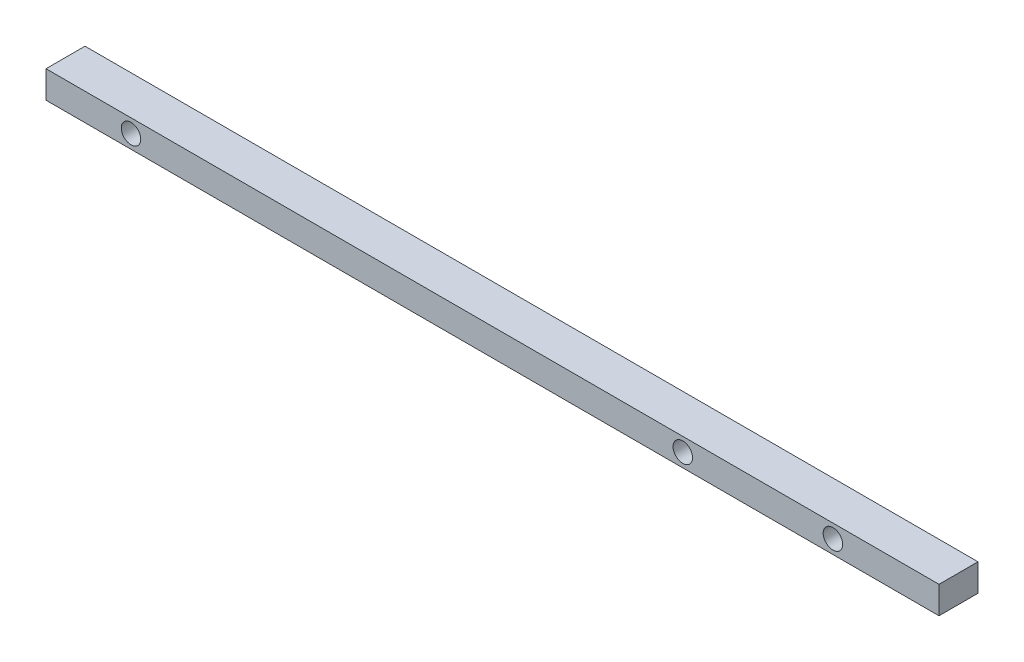
ISO-10303-21;
HEADER;
FILE_DESCRIPTION(('STEP AP214'),'2;1');
FILE_NAME('part.step','',(''),(''),'','','');
FILE_SCHEMA(('AUTOMOTIVE_DESIGN { 1 0 10303 214 1 1 1 1 }'));
ENDSEC;
DATA;
#1=APPLICATION_CONTEXT('core data for automotive mechanical design processes');
#2=APPLICATION_PROTOCOL_DEFINITION('international standard','automotive_design',2000,#1);
#3=PRODUCT_CONTEXT('',#1,'mechanical');
#4=PRODUCT('Part','Part','',(#3));
#5=PRODUCT_RELATED_PRODUCT_CATEGORY('part','',(#4));
#6=PRODUCT_DEFINITION_FORMATION('','',#4);
#7=PRODUCT_DEFINITION_CONTEXT('part definition',#1,'design');
#8=PRODUCT_DEFINITION('design','',#6,#7);
#9=PRODUCT_DEFINITION_SHAPE('','',#8);
#10=(LENGTH_UNIT() NAMED_UNIT(*) SI_UNIT(.MILLI.,.METRE.));
#11=(NAMED_UNIT(*) PLANE_ANGLE_UNIT() SI_UNIT($,.RADIAN.));
#12=(NAMED_UNIT(*) SI_UNIT($,.STERADIAN.) SOLID_ANGLE_UNIT());
#13=UNCERTAINTY_MEASURE_WITH_UNIT(LENGTH_MEASURE(1.E-05),#10,'distance_accuracy_value','');
#14=(GEOMETRIC_REPRESENTATION_CONTEXT(3) GLOBAL_UNCERTAINTY_ASSIGNED_CONTEXT((#13)) GLOBAL_UNIT_ASSIGNED_CONTEXT((#10,
#11,#12)) REPRESENTATION_CONTEXT('',''));
#15=CARTESIAN_POINT('',(0.,0.,0.));
#16=DIRECTION('',(0.,0.,1.));
#17=DIRECTION('',(1.,0.,0.));
#18=AXIS2_PLACEMENT_3D('',#15,#16,#17);
#19=CARTESIAN_POINT('',(58.166,0.,0.));
#20=DIRECTION('',(0.,0.,-1.));
#21=DIRECTION('',(-1.,0.,0.));
#22=AXIS2_PLACEMENT_3D('',#19,#20,#21);
#23=PLANE('',#22);
#24=CARTESIAN_POINT('',(41.4782,0.889,0.));
#25=DIRECTION('',(0.,0.,1.));
#26=DIRECTION('',(1.,0.,0.));
#27=AXIS2_PLACEMENT_3D('',#24,#25,#26);
#28=CIRCLE('',#27,0.634999999999995);
#29=CARTESIAN_POINT('',(42.1132,0.889,0.));
#30=VERTEX_POINT('',#29);
#31=EDGE_CURVE('E144',#30,#30,#28,.T.);
#32=ORIENTED_EDGE('',*,*,#31,.F.);
#33=EDGE_LOOP('',(#32));
#34=FACE_BOUND('',#33,.T.);
#35=CARTESIAN_POINT('',(51.2572,0.889,0.));
#36=DIRECTION('',(0.,0.,1.));
#37=DIRECTION('',(1.,0.,0.));
#38=AXIS2_PLACEMENT_3D('',#35,#36,#37);
#39=CIRCLE('',#38,0.634999999999995);
#40=CARTESIAN_POINT('',(51.8922,0.889,0.));
#41=VERTEX_POINT('',#40);
#42=EDGE_CURVE('E136',#41,#41,#39,.T.);
#43=ORIENTED_EDGE('',*,*,#42,.F.);
#44=EDGE_LOOP('',(#43));
#45=FACE_BOUND('',#44,.T.);
#46=CARTESIAN_POINT('',(5.5372,0.889,0.));
#47=DIRECTION('',(0.,0.,1.));
#48=DIRECTION('',(1.,0.,0.));
#49=AXIS2_PLACEMENT_3D('',#46,#47,#48);
#50=CIRCLE('',#49,0.635000000000001);
#51=CARTESIAN_POINT('',(6.1722,0.889,0.));
#52=VERTEX_POINT('',#51);
#53=EDGE_CURVE('E128',#52,#52,#50,.T.);
#54=ORIENTED_EDGE('',*,*,#53,.F.);
#55=EDGE_LOOP('',(#54));
#56=FACE_BOUND('',#55,.T.);
#57=DIRECTION('',(0.,-1.,0.));
#58=VECTOR('',#57,1.);
#59=CARTESIAN_POINT('',(0.,0.,0.));
#60=LINE('',#59,#58);
#61=CARTESIAN_POINT('',(0.,1.778,0.));
#62=VERTEX_POINT('',#61);
#63=CARTESIAN_POINT('',(0.,0.,0.));
#64=VERTEX_POINT('',#63);
#65=EDGE_CURVE('E107',#62,#64,#60,.T.);
#66=ORIENTED_EDGE('',*,*,#65,.T.);
#67=DIRECTION('',(-1.,0.,0.));
#68=VECTOR('',#67,1.);
#69=CARTESIAN_POINT('',(58.166,0.,0.));
#70=LINE('',#69,#68);
#71=CARTESIAN_POINT('',(58.166,0.,0.));
#72=VERTEX_POINT('',#71);
#73=EDGE_CURVE('E11',#72,#64,#70,.T.);
#74=ORIENTED_EDGE('',*,*,#73,.F.);
#75=DIRECTION('',(0.,-1.,0.));
#76=VECTOR('',#75,1.);
#77=CARTESIAN_POINT('',(58.166,0.,0.));
#78=LINE('',#77,#76);
#79=CARTESIAN_POINT('',(58.166,1.778,0.));
#80=VERTEX_POINT('',#79);
#81=EDGE_CURVE('E91',#80,#72,#78,.T.);
#82=ORIENTED_EDGE('',*,*,#81,.F.);
#83=DIRECTION('',(-1.,0.,0.));
#84=VECTOR('',#83,1.);
#85=CARTESIAN_POINT('',(58.166,1.778,0.));
#86=LINE('',#85,#84);
#87=EDGE_CURVE('E103',#80,#62,#86,.T.);
#88=ORIENTED_EDGE('',*,*,#87,.T.);
#89=EDGE_LOOP('',(#66,#74,#82,#88));
#90=FACE_BOUND('',#89,.T.);
#91=ADVANCED_FACE('F39',(#34,#45,#56,#90),#23,.F.);
#92=CARTESIAN_POINT('',(58.166,0.,0.));
#93=DIRECTION('',(0.,1.,0.));
#94=DIRECTION('',(0.,0.,1.));
#95=AXIS2_PLACEMENT_3D('',#92,#93,#94);
#96=PLANE('',#95);
#97=DIRECTION('',(0.,0.,-1.));
#98=VECTOR('',#97,1.);
#99=CARTESIAN_POINT('',(0.,0.,0.));
#100=LINE('',#99,#98);
#101=CARTESIAN_POINT('',(0.,0.,-2.54));
#102=VERTEX_POINT('',#101);
#103=EDGE_CURVE('E96',#64,#102,#100,.T.);
#104=ORIENTED_EDGE('',*,*,#103,.T.);
#105=DIRECTION('',(-1.,0.,0.));
#106=VECTOR('',#105,1.);
#107=CARTESIAN_POINT('',(58.166,0.,-2.54));
#108=LINE('',#107,#106);
#109=CARTESIAN_POINT('',(58.166,0.,-2.54));
#110=VERTEX_POINT('',#109);
#111=EDGE_CURVE('E48',#110,#102,#108,.T.);
#112=ORIENTED_EDGE('',*,*,#111,.F.);
#113=DIRECTION('',(0.,0.,-1.));
#114=VECTOR('',#113,1.);
#115=CARTESIAN_POINT('',(58.166,0.,0.));
#116=LINE('',#115,#114);
#117=EDGE_CURVE('E86',#72,#110,#116,.T.);
#118=ORIENTED_EDGE('',*,*,#117,.F.);
#119=ORIENTED_EDGE('',*,*,#73,.T.);
#120=EDGE_LOOP('',(#104,#112,#118,#119));
#121=FACE_BOUND('',#120,.T.);
#122=ADVANCED_FACE('F95',(#121),#96,.F.);
#123=CARTESIAN_POINT('',(58.166,0.,-2.54));
#124=DIRECTION('',(0.,0.,1.));
#125=DIRECTION('',(1.,0.,0.));
#126=AXIS2_PLACEMENT_3D('',#123,#124,#125);
#127=PLANE('',#126);
#128=CARTESIAN_POINT('',(41.4782,0.889,-2.54));
#129=DIRECTION('',(0.,0.,1.));
#130=DIRECTION('',(1.,0.,0.));
#131=AXIS2_PLACEMENT_3D('',#128,#129,#130);
#132=CIRCLE('',#131,0.634999999999995);
#133=CARTESIAN_POINT('',(42.1132,0.889,-2.54));
#134=VERTEX_POINT('',#133);
#135=EDGE_CURVE('E132',#134,#134,#132,.T.);
#136=ORIENTED_EDGE('',*,*,#135,.T.);
#137=EDGE_LOOP('',(#136));
#138=FACE_BOUND('',#137,.T.);
#139=CARTESIAN_POINT('',(51.2572,0.889,-2.54));
#140=DIRECTION('',(0.,0.,1.));
#141=DIRECTION('',(1.,0.,0.));
#142=AXIS2_PLACEMENT_3D('',#139,#140,#141);
#143=CIRCLE('',#142,0.634999999999995);
#144=CARTESIAN_POINT('',(51.8922,0.889,-2.54));
#145=VERTEX_POINT('',#144);
#146=EDGE_CURVE('E140',#145,#145,#143,.T.);
#147=ORIENTED_EDGE('',*,*,#146,.T.);
#148=EDGE_LOOP('',(#147));
#149=FACE_BOUND('',#148,.T.);
#150=CARTESIAN_POINT('',(5.5372,0.889,-2.54));
#151=DIRECTION('',(0.,0.,1.));
#152=DIRECTION('',(1.,0.,0.));
#153=AXIS2_PLACEMENT_3D('',#150,#151,#152);
#154=CIRCLE('',#153,0.635000000000001);
#155=CARTESIAN_POINT('',(6.1722,0.889,-2.54));
#156=VERTEX_POINT('',#155);
#157=EDGE_CURVE('E111',#156,#156,#154,.T.);
#158=ORIENTED_EDGE('',*,*,#157,.T.);
#159=EDGE_LOOP('',(#158));
#160=FACE_BOUND('',#159,.T.);
#161=DIRECTION('',(0.,1.,0.));
#162=VECTOR('',#161,1.);
#163=CARTESIAN_POINT('',(0.,0.,-2.54));
#164=LINE('',#163,#162);
#165=CARTESIAN_POINT('',(0.,1.778,-2.54));
#166=VERTEX_POINT('',#165);
#167=EDGE_CURVE('E73',#102,#166,#164,.T.);
#168=ORIENTED_EDGE('',*,*,#167,.T.);
#169=DIRECTION('',(-1.,0.,0.));
#170=VECTOR('',#169,1.);
#171=CARTESIAN_POINT('',(58.166,1.778,-2.54));
#172=LINE('',#171,#170);
#173=CARTESIAN_POINT('',(58.166,1.778,-2.54));
#174=VERTEX_POINT('',#173);
#175=EDGE_CURVE('E98',#174,#166,#172,.T.);
#176=ORIENTED_EDGE('',*,*,#175,.F.);
#177=DIRECTION('',(0.,1.,0.));
#178=VECTOR('',#177,1.);
#179=CARTESIAN_POINT('',(58.166,0.,-2.54));
#180=LINE('',#179,#178);
#181=EDGE_CURVE('E89',#110,#174,#180,.T.);
#182=ORIENTED_EDGE('',*,*,#181,.F.);
#183=ORIENTED_EDGE('',*,*,#111,.T.);
#184=EDGE_LOOP('',(#168,#176,#182,#183));
#185=FACE_BOUND('',#184,.T.);
#186=ADVANCED_FACE('F99',(#138,#149,#160,#185),#127,.F.);
#187=CARTESIAN_POINT('',(58.166,1.778,0.));
#188=DIRECTION('',(0.,-1.,0.));
#189=DIRECTION('',(0.,0.,-1.));
#190=AXIS2_PLACEMENT_3D('',#187,#188,#189);
#191=PLANE('',#190);
#192=DIRECTION('',(0.,0.,1.));
#193=VECTOR('',#192,1.);
#194=CARTESIAN_POINT('',(0.,1.778,0.));
#195=LINE('',#194,#193);
#196=EDGE_CURVE('E79',#166,#62,#195,.T.);
#197=ORIENTED_EDGE('',*,*,#196,.T.);
#198=ORIENTED_EDGE('',*,*,#87,.F.);
#199=DIRECTION('',(0.,0.,1.));
#200=VECTOR('',#199,1.);
#201=CARTESIAN_POINT('',(58.166,1.778,0.));
#202=LINE('',#201,#200);
#203=EDGE_CURVE('E56',#174,#80,#202,.T.);
#204=ORIENTED_EDGE('',*,*,#203,.F.);
#205=ORIENTED_EDGE('',*,*,#175,.T.);
#206=EDGE_LOOP('',(#197,#198,#204,#205));
#207=FACE_BOUND('',#206,.T.);
#208=ADVANCED_FACE('F121',(#207),#191,.F.);
#209=CARTESIAN_POINT('',(58.166,0.,0.));
#210=DIRECTION('',(-1.,0.,0.));
#211=DIRECTION('',(0.,0.,1.));
#212=AXIS2_PLACEMENT_3D('',#209,#210,#211);
#213=PLANE('',#212);
#214=ORIENTED_EDGE('',*,*,#81,.T.);
#215=ORIENTED_EDGE('',*,*,#117,.T.);
#216=ORIENTED_EDGE('',*,*,#181,.T.);
#217=ORIENTED_EDGE('',*,*,#203,.T.);
#218=EDGE_LOOP('',(#214,#215,#216,#217));
#219=FACE_BOUND('',#218,.T.);
#220=ADVANCED_FACE('F87',(#219),#213,.F.);
#221=CARTESIAN_POINT('',(0.,0.,0.));
#222=DIRECTION('',(-1.,0.,0.));
#223=DIRECTION('',(0.,0.,1.));
#224=AXIS2_PLACEMENT_3D('',#221,#222,#223);
#225=PLANE('',#224);
#226=ORIENTED_EDGE('',*,*,#65,.F.);
#227=ORIENTED_EDGE('',*,*,#196,.F.);
#228=ORIENTED_EDGE('',*,*,#167,.F.);
#229=ORIENTED_EDGE('',*,*,#103,.F.);
#230=EDGE_LOOP('',(#226,#227,#228,#229));
#231=FACE_BOUND('',#230,.T.);
#232=ADVANCED_FACE('F124',(#231),#225,.T.);
#233=CARTESIAN_POINT('',(5.5372,0.889,-2.54));
#234=DIRECTION('',(0.,0.,1.));
#235=DIRECTION('',(1.,0.,0.));
#236=AXIS2_PLACEMENT_3D('',#233,#234,#235);
#237=CYLINDRICAL_SURFACE('',#236,0.635000000000001);
#238=ORIENTED_EDGE('',*,*,#157,.F.);
#239=EDGE_LOOP('',(#238));
#240=FACE_BOUND('',#239,.T.);
#241=ORIENTED_EDGE('',*,*,#53,.T.);
#242=EDGE_LOOP('',(#241));
#243=FACE_BOUND('',#242,.T.);
#244=ADVANCED_FACE('F167',(#240,#243),#237,.F.);
#245=CARTESIAN_POINT('',(51.2572,0.889,-2.54));
#246=DIRECTION('',(0.,0.,1.));
#247=DIRECTION('',(1.,0.,0.));
#248=AXIS2_PLACEMENT_3D('',#245,#246,#247);
#249=CYLINDRICAL_SURFACE('',#248,0.634999999999995);
#250=ORIENTED_EDGE('',*,*,#146,.F.);
#251=EDGE_LOOP('',(#250));
#252=FACE_BOUND('',#251,.T.);
#253=ORIENTED_EDGE('',*,*,#42,.T.);
#254=EDGE_LOOP('',(#253));
#255=FACE_BOUND('',#254,.T.);
#256=ADVANCED_FACE('F157',(#252,#255),#249,.F.);
#257=CARTESIAN_POINT('',(41.4782,0.889,-2.54));
#258=DIRECTION('',(0.,0.,1.));
#259=DIRECTION('',(1.,0.,0.));
#260=AXIS2_PLACEMENT_3D('',#257,#258,#259);
#261=CYLINDRICAL_SURFACE('',#260,0.634999999999995);
#262=ORIENTED_EDGE('',*,*,#135,.F.);
#263=EDGE_LOOP('',(#262));
#264=FACE_BOUND('',#263,.T.);
#265=ORIENTED_EDGE('',*,*,#31,.T.);
#266=EDGE_LOOP('',(#265));
#267=FACE_BOUND('',#266,.T.);
#268=ADVANCED_FACE('F154',(#264,#267),#261,.F.);
#269=CLOSED_SHELL('',(#91,#122,#186,#208,#220,#232,#244,#256,#268));
#270=MANIFOLD_SOLID_BREP('B2',#269);
#271=ADVANCED_BREP_SHAPE_REPRESENTATION('',(#18,#270),#14);
#272=SHAPE_DEFINITION_REPRESENTATION(#9,#271);
ENDSEC;
END-ISO-10303-21;
